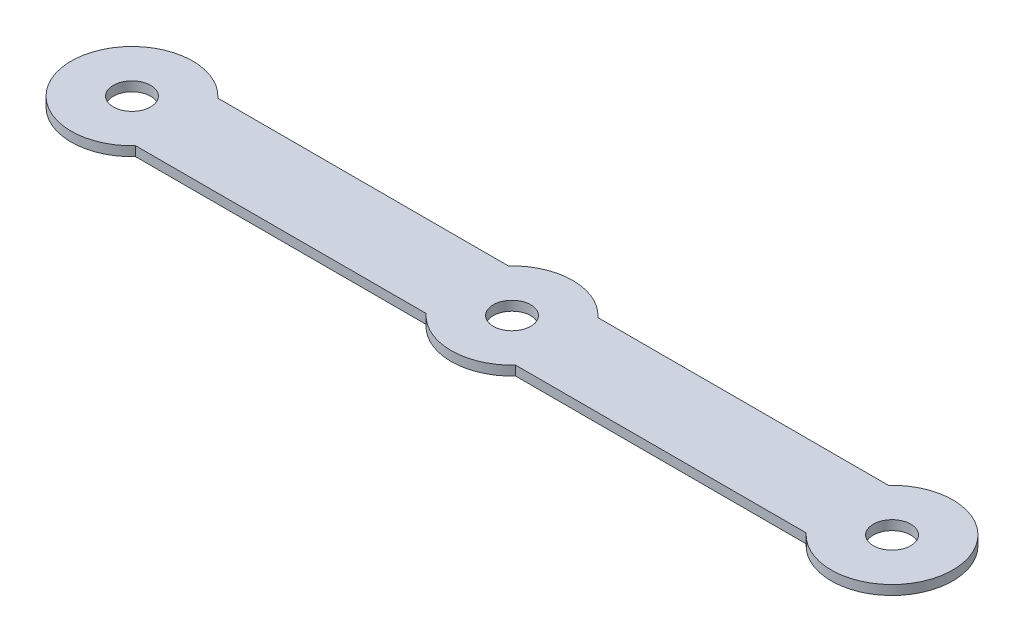
ISO-10303-21;
HEADER;
FILE_DESCRIPTION(('STEP AP214'),'2;1');
FILE_NAME('part.step','',(''),(''),'','','');
FILE_SCHEMA(('AUTOMOTIVE_DESIGN { 1 0 10303 214 1 1 1 1 }'));
ENDSEC;
DATA;
#1=APPLICATION_CONTEXT('core data for automotive mechanical design processes');
#2=APPLICATION_PROTOCOL_DEFINITION('international standard','automotive_design',2000,#1);
#3=PRODUCT_CONTEXT('',#1,'mechanical');
#4=PRODUCT('Part','Part','',(#3));
#5=PRODUCT_RELATED_PRODUCT_CATEGORY('part','',(#4));
#6=PRODUCT_DEFINITION_FORMATION('','',#4);
#7=PRODUCT_DEFINITION_CONTEXT('part definition',#1,'design');
#8=PRODUCT_DEFINITION('design','',#6,#7);
#9=PRODUCT_DEFINITION_SHAPE('','',#8);
#10=(LENGTH_UNIT() NAMED_UNIT(*) SI_UNIT(.MILLI.,.METRE.));
#11=(NAMED_UNIT(*) PLANE_ANGLE_UNIT() SI_UNIT($,.RADIAN.));
#12=(NAMED_UNIT(*) SI_UNIT($,.STERADIAN.) SOLID_ANGLE_UNIT());
#13=UNCERTAINTY_MEASURE_WITH_UNIT(LENGTH_MEASURE(1.E-05),#10,'distance_accuracy_value','');
#14=(GEOMETRIC_REPRESENTATION_CONTEXT(3) GLOBAL_UNCERTAINTY_ASSIGNED_CONTEXT((#13)) GLOBAL_UNIT_ASSIGNED_CONTEXT((#10,
#11,#12)) REPRESENTATION_CONTEXT('',''));
#15=CARTESIAN_POINT('',(0.,0.,0.));
#16=DIRECTION('',(0.,0.,1.));
#17=DIRECTION('',(1.,0.,0.));
#18=AXIS2_PLACEMENT_3D('',#15,#16,#17);
#19=CARTESIAN_POINT('',(-101.6,2.54,0.));
#20=DIRECTION('',(0.,-1.,0.));
#21=DIRECTION('',(0.,0.,-1.));
#22=AXIS2_PLACEMENT_3D('',#19,#20,#21);
#23=CYLINDRICAL_SURFACE('',#22,16.252288298);
#24=CARTESIAN_POINT('',(-101.6,0.,0.));
#25=DIRECTION('',(0.,1.,0.));
#26=DIRECTION('',(0.,0.,1.));
#27=AXIS2_PLACEMENT_3D('',#24,#25,#26);
#28=CIRCLE('',#27,16.252288298);
#29=CARTESIAN_POINT('',(-89.6360175977517,0.,-11.));
#30=VERTEX_POINT('',#29);
#31=CARTESIAN_POINT('',(-89.6360175977516,0.,11.));
#32=VERTEX_POINT('',#31);
#33=EDGE_CURVE('E129',#30,#32,#28,.T.);
#34=ORIENTED_EDGE('',*,*,#33,.T.);
#35=DIRECTION('',(0.,-1.,0.));
#36=VECTOR('',#35,1.);
#37=CARTESIAN_POINT('',(-89.6360175977516,2.54,11.));
#38=LINE('',#37,#36);
#39=CARTESIAN_POINT('',(-89.6360175977516,2.54,11.));
#40=VERTEX_POINT('',#39);
#41=EDGE_CURVE('E11',#40,#32,#38,.T.);
#42=ORIENTED_EDGE('',*,*,#41,.F.);
#43=CARTESIAN_POINT('',(-101.6,2.54,0.));
#44=DIRECTION('',(0.,1.,0.));
#45=DIRECTION('',(0.,0.,1.));
#46=AXIS2_PLACEMENT_3D('',#43,#44,#45);
#47=CIRCLE('',#46,16.252288298);
#48=CARTESIAN_POINT('',(-89.6360175977517,2.54,-11.));
#49=VERTEX_POINT('',#48);
#50=EDGE_CURVE('E144',#49,#40,#47,.T.);
#51=ORIENTED_EDGE('',*,*,#50,.F.);
#52=DIRECTION('',(0.,-1.,0.));
#53=VECTOR('',#52,1.);
#54=CARTESIAN_POINT('',(-89.6360175977517,2.54,-11.));
#55=LINE('',#54,#53);
#56=EDGE_CURVE('E125',#49,#30,#55,.T.);
#57=ORIENTED_EDGE('',*,*,#56,.T.);
#58=EDGE_LOOP('',(#34,#42,#51,#57));
#59=FACE_BOUND('',#58,.T.);
#60=ADVANCED_FACE('F33',(#59),#23,.T.);
#61=CARTESIAN_POINT('',(-11.9639824022483,2.54,11.));
#62=DIRECTION('',(0.,0.,-1.));
#63=DIRECTION('',(-1.,0.,0.));
#64=AXIS2_PLACEMENT_3D('',#61,#62,#63);
#65=PLANE('',#64);
#66=DIRECTION('',(1.,0.,0.));
#67=VECTOR('',#66,1.);
#68=CARTESIAN_POINT('',(-11.9639824022483,0.,11.));
#69=LINE('',#68,#67);
#70=CARTESIAN_POINT('',(-11.9639824022484,0.,11.));
#71=VERTEX_POINT('',#70);
#72=EDGE_CURVE('E132',#32,#71,#69,.T.);
#73=ORIENTED_EDGE('',*,*,#72,.T.);
#74=DIRECTION('',(0.,-1.,0.));
#75=VECTOR('',#74,1.);
#76=CARTESIAN_POINT('',(-11.9639824022484,2.54,11.));
#77=LINE('',#76,#75);
#78=CARTESIAN_POINT('',(-11.9639824022484,2.54,11.));
#79=VERTEX_POINT('',#78);
#80=EDGE_CURVE('E41',#79,#71,#77,.T.);
#81=ORIENTED_EDGE('',*,*,#80,.F.);
#82=DIRECTION('',(1.,0.,0.));
#83=VECTOR('',#82,1.);
#84=CARTESIAN_POINT('',(-11.9639824022483,2.54,11.));
#85=LINE('',#84,#83);
#86=EDGE_CURVE('E92',#40,#79,#85,.T.);
#87=ORIENTED_EDGE('',*,*,#86,.F.);
#88=ORIENTED_EDGE('',*,*,#41,.T.);
#89=EDGE_LOOP('',(#73,#81,#87,#88));
#90=FACE_BOUND('',#89,.T.);
#91=ADVANCED_FACE('F209',(#90),#65,.F.);
#92=CARTESIAN_POINT('',(0.,2.54,0.));
#93=DIRECTION('',(0.,-1.,0.));
#94=DIRECTION('',(0.,0.,-1.));
#95=AXIS2_PLACEMENT_3D('',#92,#93,#94);
#96=CYLINDRICAL_SURFACE('',#95,16.252288298);
#97=CARTESIAN_POINT('',(0.,0.,0.));
#98=DIRECTION('',(0.,1.,0.));
#99=DIRECTION('',(0.,0.,1.));
#100=AXIS2_PLACEMENT_3D('',#97,#98,#99);
#101=CIRCLE('',#100,16.252288298);
#102=CARTESIAN_POINT('',(11.9639824022483,0.,11.));
#103=VERTEX_POINT('',#102);
#104=EDGE_CURVE('E135',#71,#103,#101,.T.);
#105=ORIENTED_EDGE('',*,*,#104,.T.);
#106=DIRECTION('',(0.,-1.,0.));
#107=VECTOR('',#106,1.);
#108=CARTESIAN_POINT('',(11.9639824022483,2.54,11.));
#109=LINE('',#108,#107);
#110=CARTESIAN_POINT('',(11.9639824022483,2.54,11.));
#111=VERTEX_POINT('',#110);
#112=EDGE_CURVE('E151',#111,#103,#109,.T.);
#113=ORIENTED_EDGE('',*,*,#112,.F.);
#114=CARTESIAN_POINT('',(0.,2.54,0.));
#115=DIRECTION('',(0.,1.,0.));
#116=DIRECTION('',(0.,0.,1.));
#117=AXIS2_PLACEMENT_3D('',#114,#115,#116);
#118=CIRCLE('',#117,16.252288298);
#119=EDGE_CURVE('E159',#79,#111,#118,.T.);
#120=ORIENTED_EDGE('',*,*,#119,.F.);
#121=ORIENTED_EDGE('',*,*,#80,.T.);
#122=EDGE_LOOP('',(#105,#113,#120,#121));
#123=FACE_BOUND('',#122,.T.);
#124=ADVANCED_FACE('F157',(#123),#96,.T.);
#125=CARTESIAN_POINT('',(89.6360175977516,2.54,11.));
#126=DIRECTION('',(0.,0.,-1.));
#127=DIRECTION('',(-1.,0.,0.));
#128=AXIS2_PLACEMENT_3D('',#125,#126,#127);
#129=PLANE('',#128);
#130=DIRECTION('',(1.,0.,0.));
#131=VECTOR('',#130,1.);
#132=CARTESIAN_POINT('',(89.6360175977516,0.,11.));
#133=LINE('',#132,#131);
#134=CARTESIAN_POINT('',(89.6360175977516,0.,11.));
#135=VERTEX_POINT('',#134);
#136=EDGE_CURVE('E137',#103,#135,#133,.T.);
#137=ORIENTED_EDGE('',*,*,#136,.T.);
#138=DIRECTION('',(0.,-1.,0.));
#139=VECTOR('',#138,1.);
#140=CARTESIAN_POINT('',(89.6360175977516,2.54,11.));
#141=LINE('',#140,#139);
#142=CARTESIAN_POINT('',(89.6360175977516,2.54,11.));
#143=VERTEX_POINT('',#142);
#144=EDGE_CURVE('E148',#143,#135,#141,.T.);
#145=ORIENTED_EDGE('',*,*,#144,.F.);
#146=DIRECTION('',(1.,0.,0.));
#147=VECTOR('',#146,1.);
#148=CARTESIAN_POINT('',(89.6360175977516,2.54,11.));
#149=LINE('',#148,#147);
#150=EDGE_CURVE('E171',#111,#143,#149,.T.);
#151=ORIENTED_EDGE('',*,*,#150,.F.);
#152=ORIENTED_EDGE('',*,*,#112,.T.);
#153=EDGE_LOOP('',(#137,#145,#151,#152));
#154=FACE_BOUND('',#153,.T.);
#155=ADVANCED_FACE('F167',(#154),#129,.F.);
#156=CARTESIAN_POINT('',(101.6,2.54,0.));
#157=DIRECTION('',(0.,-1.,0.));
#158=DIRECTION('',(0.,0.,-1.));
#159=AXIS2_PLACEMENT_3D('',#156,#157,#158);
#160=CYLINDRICAL_SURFACE('',#159,16.252288298);
#161=CARTESIAN_POINT('',(101.6,0.,0.));
#162=DIRECTION('',(0.,1.,0.));
#163=DIRECTION('',(0.,0.,1.));
#164=AXIS2_PLACEMENT_3D('',#161,#162,#163);
#165=CIRCLE('',#164,16.252288298);
#166=CARTESIAN_POINT('',(89.6360175977516,0.,-11.));
#167=VERTEX_POINT('',#166);
#168=EDGE_CURVE('E139',#135,#167,#165,.T.);
#169=ORIENTED_EDGE('',*,*,#168,.T.);
#170=DIRECTION('',(0.,-1.,0.));
#171=VECTOR('',#170,1.);
#172=CARTESIAN_POINT('',(89.6360175977516,2.54,-11.));
#173=LINE('',#172,#171);
#174=CARTESIAN_POINT('',(89.6360175977516,2.54,-11.));
#175=VERTEX_POINT('',#174);
#176=EDGE_CURVE('E120',#175,#167,#173,.T.);
#177=ORIENTED_EDGE('',*,*,#176,.F.);
#178=CARTESIAN_POINT('',(101.6,2.54,0.));
#179=DIRECTION('',(0.,1.,0.));
#180=DIRECTION('',(0.,0.,1.));
#181=AXIS2_PLACEMENT_3D('',#178,#179,#180);
#182=CIRCLE('',#181,16.252288298);
#183=EDGE_CURVE('E111',#143,#175,#182,.T.);
#184=ORIENTED_EDGE('',*,*,#183,.F.);
#185=ORIENTED_EDGE('',*,*,#144,.T.);
#186=EDGE_LOOP('',(#169,#177,#184,#185));
#187=FACE_BOUND('',#186,.T.);
#188=ADVANCED_FACE('F170',(#187),#160,.T.);
#189=CARTESIAN_POINT('',(11.9639824022483,2.54,-11.));
#190=DIRECTION('',(0.,0.,1.));
#191=DIRECTION('',(1.,0.,0.));
#192=AXIS2_PLACEMENT_3D('',#189,#190,#191);
#193=PLANE('',#192);
#194=DIRECTION('',(-1.,0.,0.));
#195=VECTOR('',#194,1.);
#196=CARTESIAN_POINT('',(11.9639824022483,0.,-11.));
#197=LINE('',#196,#195);
#198=CARTESIAN_POINT('',(11.9639824022483,0.,-11.));
#199=VERTEX_POINT('',#198);
#200=EDGE_CURVE('E119',#167,#199,#197,.T.);
#201=ORIENTED_EDGE('',*,*,#200,.T.);
#202=DIRECTION('',(0.,-1.,0.));
#203=VECTOR('',#202,1.);
#204=CARTESIAN_POINT('',(11.9639824022483,2.54,-11.));
#205=LINE('',#204,#203);
#206=CARTESIAN_POINT('',(11.9639824022483,2.54,-11.));
#207=VERTEX_POINT('',#206);
#208=EDGE_CURVE('E116',#207,#199,#205,.T.);
#209=ORIENTED_EDGE('',*,*,#208,.F.);
#210=DIRECTION('',(-1.,0.,0.));
#211=VECTOR('',#210,1.);
#212=CARTESIAN_POINT('',(11.9639824022483,2.54,-11.));
#213=LINE('',#212,#211);
#214=EDGE_CURVE('E105',#175,#207,#213,.T.);
#215=ORIENTED_EDGE('',*,*,#214,.F.);
#216=ORIENTED_EDGE('',*,*,#176,.T.);
#217=EDGE_LOOP('',(#201,#209,#215,#216));
#218=FACE_BOUND('',#217,.T.);
#219=ADVANCED_FACE('F117',(#218),#193,.F.);
#220=CARTESIAN_POINT('',(0.,2.54,0.));
#221=DIRECTION('',(0.,-1.,0.));
#222=DIRECTION('',(0.,0.,-1.));
#223=AXIS2_PLACEMENT_3D('',#220,#221,#222);
#224=CYLINDRICAL_SURFACE('',#223,16.252288298);
#225=CARTESIAN_POINT('',(0.,0.,0.));
#226=DIRECTION('',(0.,1.,0.));
#227=DIRECTION('',(0.,0.,1.));
#228=AXIS2_PLACEMENT_3D('',#225,#226,#227);
#229=CIRCLE('',#228,16.252288298);
#230=CARTESIAN_POINT('',(-11.9639824022483,0.,-11.));
#231=VERTEX_POINT('',#230);
#232=EDGE_CURVE('E78',#199,#231,#229,.T.);
#233=ORIENTED_EDGE('',*,*,#232,.T.);
#234=DIRECTION('',(0.,-1.,0.));
#235=VECTOR('',#234,1.);
#236=CARTESIAN_POINT('',(-11.9639824022483,2.54,-11.));
#237=LINE('',#236,#235);
#238=CARTESIAN_POINT('',(-11.9639824022483,2.54,-11.));
#239=VERTEX_POINT('',#238);
#240=EDGE_CURVE('E121',#239,#231,#237,.T.);
#241=ORIENTED_EDGE('',*,*,#240,.F.);
#242=CARTESIAN_POINT('',(0.,2.54,0.));
#243=DIRECTION('',(0.,1.,0.));
#244=DIRECTION('',(0.,0.,1.));
#245=AXIS2_PLACEMENT_3D('',#242,#243,#244);
#246=CIRCLE('',#245,16.252288298);
#247=EDGE_CURVE('E109',#207,#239,#246,.T.);
#248=ORIENTED_EDGE('',*,*,#247,.F.);
#249=ORIENTED_EDGE('',*,*,#208,.T.);
#250=EDGE_LOOP('',(#233,#241,#248,#249));
#251=FACE_BOUND('',#250,.T.);
#252=ADVANCED_FACE('F123',(#251),#224,.T.);
#253=CARTESIAN_POINT('',(-89.6360175977517,2.54,-11.));
#254=DIRECTION('',(0.,0.,1.));
#255=DIRECTION('',(1.,0.,0.));
#256=AXIS2_PLACEMENT_3D('',#253,#254,#255);
#257=PLANE('',#256);
#258=DIRECTION('',(-1.,0.,0.));
#259=VECTOR('',#258,1.);
#260=CARTESIAN_POINT('',(-89.6360175977517,0.,-11.));
#261=LINE('',#260,#259);
#262=EDGE_CURVE('E84',#231,#30,#261,.T.);
#263=ORIENTED_EDGE('',*,*,#262,.T.);
#264=ORIENTED_EDGE('',*,*,#56,.F.);
#265=DIRECTION('',(-1.,0.,0.));
#266=VECTOR('',#265,1.);
#267=CARTESIAN_POINT('',(-89.6360175977517,2.54,-11.));
#268=LINE('',#267,#266);
#269=EDGE_CURVE('E49',#239,#49,#268,.T.);
#270=ORIENTED_EDGE('',*,*,#269,.F.);
#271=ORIENTED_EDGE('',*,*,#240,.T.);
#272=EDGE_LOOP('',(#263,#264,#270,#271));
#273=FACE_BOUND('',#272,.T.);
#274=ADVANCED_FACE('F216',(#273),#257,.F.);
#275=CARTESIAN_POINT('',(-101.6,2.54,0.));
#276=DIRECTION('',(0.,1.,0.));
#277=DIRECTION('',(0.,0.,1.));
#278=AXIS2_PLACEMENT_3D('',#275,#276,#277);
#279=PLANE('',#278);
#280=CARTESIAN_POINT('',(-101.6,2.54,0.));
#281=DIRECTION('',(0.,1.,0.));
#282=DIRECTION('',(0.,0.,1.));
#283=AXIS2_PLACEMENT_3D('',#280,#281,#282);
#284=CIRCLE('',#283,5.);
#285=CARTESIAN_POINT('',(-101.6,2.54,5.));
#286=VERTEX_POINT('',#285);
#287=EDGE_CURVE('E133',#286,#286,#284,.T.);
#288=ORIENTED_EDGE('',*,*,#287,.F.);
#289=EDGE_LOOP('',(#288));
#290=FACE_BOUND('',#289,.T.);
#291=CARTESIAN_POINT('',(101.6,2.54,0.));
#292=DIRECTION('',(0.,1.,0.));
#293=DIRECTION('',(0.,0.,1.));
#294=AXIS2_PLACEMENT_3D('',#291,#292,#293);
#295=CIRCLE('',#294,5.);
#296=CARTESIAN_POINT('',(101.6,2.54,5.));
#297=VERTEX_POINT('',#296);
#298=EDGE_CURVE('E179',#297,#297,#295,.T.);
#299=ORIENTED_EDGE('',*,*,#298,.F.);
#300=EDGE_LOOP('',(#299));
#301=FACE_BOUND('',#300,.T.);
#302=CARTESIAN_POINT('',(0.,2.54,0.));
#303=DIRECTION('',(0.,1.,0.));
#304=DIRECTION('',(0.,0.,1.));
#305=AXIS2_PLACEMENT_3D('',#302,#303,#304);
#306=CIRCLE('',#305,5.);
#307=CARTESIAN_POINT('',(0.,2.54,5.));
#308=VERTEX_POINT('',#307);
#309=EDGE_CURVE('E182',#308,#308,#306,.T.);
#310=ORIENTED_EDGE('',*,*,#309,.F.);
#311=EDGE_LOOP('',(#310));
#312=FACE_BOUND('',#311,.T.);
#313=ORIENTED_EDGE('',*,*,#50,.T.);
#314=ORIENTED_EDGE('',*,*,#86,.T.);
#315=ORIENTED_EDGE('',*,*,#119,.T.);
#316=ORIENTED_EDGE('',*,*,#150,.T.);
#317=ORIENTED_EDGE('',*,*,#183,.T.);
#318=ORIENTED_EDGE('',*,*,#214,.T.);
#319=ORIENTED_EDGE('',*,*,#247,.T.);
#320=ORIENTED_EDGE('',*,*,#269,.T.);
#321=EDGE_LOOP('',(#313,#314,#315,#316,#317,#318,#319,#320));
#322=FACE_BOUND('',#321,.T.);
#323=ADVANCED_FACE('F107',(#290,#301,#312,#322),#279,.T.);
#324=CARTESIAN_POINT('',(-101.6,0.,0.));
#325=DIRECTION('',(0.,1.,0.));
#326=DIRECTION('',(0.,0.,1.));
#327=AXIS2_PLACEMENT_3D('',#324,#325,#326);
#328=PLANE('',#327);
#329=CARTESIAN_POINT('',(-101.6,0.,0.));
#330=DIRECTION('',(0.,1.,0.));
#331=DIRECTION('',(0.,0.,1.));
#332=AXIS2_PLACEMENT_3D('',#329,#330,#331);
#333=CIRCLE('',#332,5.);
#334=CARTESIAN_POINT('',(-101.6,0.,5.));
#335=VERTEX_POINT('',#334);
#336=EDGE_CURVE('E185',#335,#335,#333,.T.);
#337=ORIENTED_EDGE('',*,*,#336,.T.);
#338=EDGE_LOOP('',(#337));
#339=FACE_BOUND('',#338,.T.);
#340=CARTESIAN_POINT('',(101.6,0.,0.));
#341=DIRECTION('',(0.,1.,0.));
#342=DIRECTION('',(0.,0.,1.));
#343=AXIS2_PLACEMENT_3D('',#340,#341,#342);
#344=CIRCLE('',#343,5.);
#345=CARTESIAN_POINT('',(101.6,0.,5.));
#346=VERTEX_POINT('',#345);
#347=EDGE_CURVE('E189',#346,#346,#344,.T.);
#348=ORIENTED_EDGE('',*,*,#347,.T.);
#349=EDGE_LOOP('',(#348));
#350=FACE_BOUND('',#349,.T.);
#351=CARTESIAN_POINT('',(0.,0.,0.));
#352=DIRECTION('',(0.,1.,0.));
#353=DIRECTION('',(0.,0.,1.));
#354=AXIS2_PLACEMENT_3D('',#351,#352,#353);
#355=CIRCLE('',#354,5.);
#356=CARTESIAN_POINT('',(0.,0.,5.));
#357=VERTEX_POINT('',#356);
#358=EDGE_CURVE('E186',#357,#357,#355,.T.);
#359=ORIENTED_EDGE('',*,*,#358,.T.);
#360=EDGE_LOOP('',(#359));
#361=FACE_BOUND('',#360,.T.);
#362=ORIENTED_EDGE('',*,*,#33,.F.);
#363=ORIENTED_EDGE('',*,*,#262,.F.);
#364=ORIENTED_EDGE('',*,*,#232,.F.);
#365=ORIENTED_EDGE('',*,*,#200,.F.);
#366=ORIENTED_EDGE('',*,*,#168,.F.);
#367=ORIENTED_EDGE('',*,*,#136,.F.);
#368=ORIENTED_EDGE('',*,*,#104,.F.);
#369=ORIENTED_EDGE('',*,*,#72,.F.);
#370=EDGE_LOOP('',(#362,#363,#364,#365,#366,#367,#368,#369));
#371=FACE_BOUND('',#370,.T.);
#372=ADVANCED_FACE('F163',(#339,#350,#361,#371),#328,.F.);
#373=CARTESIAN_POINT('',(0.,0.,0.));
#374=DIRECTION('',(0.,1.,0.));
#375=DIRECTION('',(0.,0.,1.));
#376=AXIS2_PLACEMENT_3D('',#373,#374,#375);
#377=CYLINDRICAL_SURFACE('',#376,5.);
#378=ORIENTED_EDGE('',*,*,#309,.T.);
#379=EDGE_LOOP('',(#378));
#380=FACE_BOUND('',#379,.T.);
#381=ORIENTED_EDGE('',*,*,#358,.F.);
#382=EDGE_LOOP('',(#381));
#383=FACE_BOUND('',#382,.T.);
#384=ADVANCED_FACE('F205',(#380,#383),#377,.F.);
#385=CARTESIAN_POINT('',(101.6,0.,0.));
#386=DIRECTION('',(0.,1.,0.));
#387=DIRECTION('',(0.,0.,1.));
#388=AXIS2_PLACEMENT_3D('',#385,#386,#387);
#389=CYLINDRICAL_SURFACE('',#388,5.);
#390=ORIENTED_EDGE('',*,*,#298,.T.);
#391=EDGE_LOOP('',(#390));
#392=FACE_BOUND('',#391,.T.);
#393=ORIENTED_EDGE('',*,*,#347,.F.);
#394=EDGE_LOOP('',(#393));
#395=FACE_BOUND('',#394,.T.);
#396=ADVANCED_FACE('F199',(#392,#395),#389,.F.);
#397=CARTESIAN_POINT('',(-101.6,0.,0.));
#398=DIRECTION('',(0.,1.,0.));
#399=DIRECTION('',(0.,0.,1.));
#400=AXIS2_PLACEMENT_3D('',#397,#398,#399);
#401=CYLINDRICAL_SURFACE('',#400,5.);
#402=ORIENTED_EDGE('',*,*,#287,.T.);
#403=EDGE_LOOP('',(#402));
#404=FACE_BOUND('',#403,.T.);
#405=ORIENTED_EDGE('',*,*,#336,.F.);
#406=EDGE_LOOP('',(#405));
#407=FACE_BOUND('',#406,.T.);
#408=ADVANCED_FACE('F197',(#404,#407),#401,.F.);
#409=CLOSED_SHELL('',(#60,#91,#124,#155,#188,#219,#252,#274,#323,#372,#384,#396,#408));
#410=MANIFOLD_SOLID_BREP('B2',#409);
#411=ADVANCED_BREP_SHAPE_REPRESENTATION('',(#18,#410),#14);
#412=SHAPE_DEFINITION_REPRESENTATION(#9,#411);
ENDSEC;
END-ISO-10303-21;
